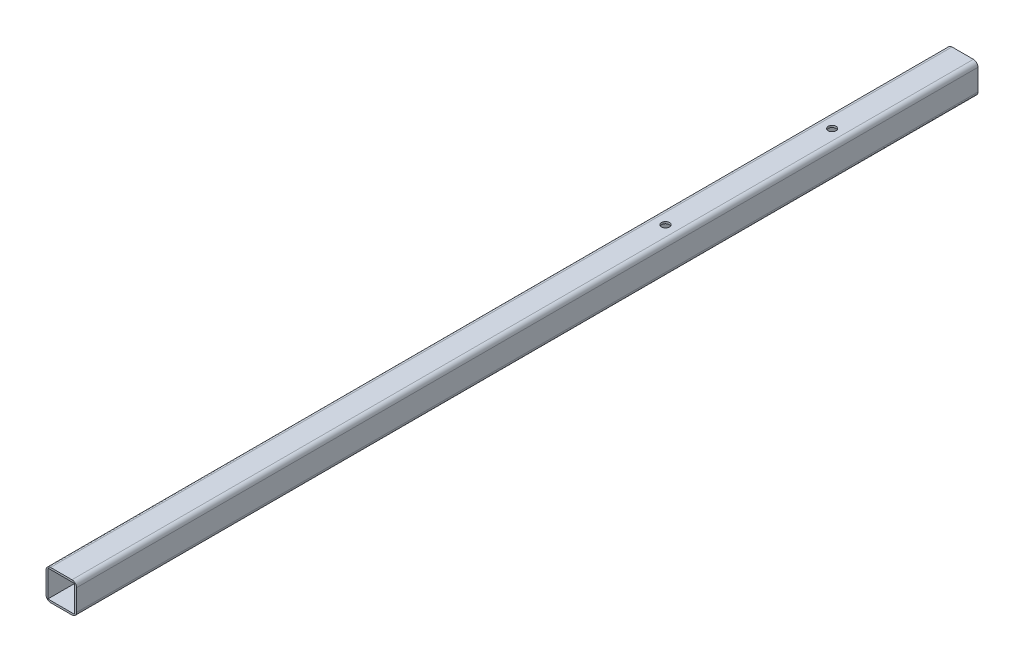
ISO-10303-21;
HEADER;
FILE_DESCRIPTION(('STEP AP214'),'2;1');
FILE_NAME('part.step','',(''),(''),'','','');
FILE_SCHEMA(('AUTOMOTIVE_DESIGN { 1 0 10303 214 1 1 1 1 }'));
ENDSEC;
DATA;
#1=APPLICATION_CONTEXT('core data for automotive mechanical design processes');
#2=APPLICATION_PROTOCOL_DEFINITION('international standard','automotive_design',2000,#1);
#3=PRODUCT_CONTEXT('',#1,'mechanical');
#4=PRODUCT('Part','Part','',(#3));
#5=PRODUCT_RELATED_PRODUCT_CATEGORY('part','',(#4));
#6=PRODUCT_DEFINITION_FORMATION('','',#4);
#7=PRODUCT_DEFINITION_CONTEXT('part definition',#1,'design');
#8=PRODUCT_DEFINITION('design','',#6,#7);
#9=PRODUCT_DEFINITION_SHAPE('','',#8);
#10=(LENGTH_UNIT() NAMED_UNIT(*) SI_UNIT(.MILLI.,.METRE.));
#11=(NAMED_UNIT(*) PLANE_ANGLE_UNIT() SI_UNIT($,.RADIAN.));
#12=(NAMED_UNIT(*) SI_UNIT($,.STERADIAN.) SOLID_ANGLE_UNIT());
#13=UNCERTAINTY_MEASURE_WITH_UNIT(LENGTH_MEASURE(1.E-05),#10,'distance_accuracy_value','');
#14=(GEOMETRIC_REPRESENTATION_CONTEXT(3) GLOBAL_UNCERTAINTY_ASSIGNED_CONTEXT((#13)) GLOBAL_UNIT_ASSIGNED_CONTEXT((#10,
#11,#12)) REPRESENTATION_CONTEXT('',''));
#15=CARTESIAN_POINT('',(0.,0.,0.));
#16=DIRECTION('',(0.,0.,1.));
#17=DIRECTION('',(1.,0.,0.));
#18=AXIS2_PLACEMENT_3D('',#15,#16,#17);
#19=CARTESIAN_POINT('',(0.,0.,374.65));
#20=DIRECTION('',(0.,0.,-1.));
#21=DIRECTION('',(-1.,0.,0.));
#22=AXIS2_PLACEMENT_3D('',#19,#20,#21);
#23=PLANE('',#22);
#24=DIRECTION('',(0.,-1.,0.));
#25=VECTOR('',#24,1.);
#26=CARTESIAN_POINT('',(-12.7,-12.7,374.65));
#27=LINE('',#26,#25);
#28=CARTESIAN_POINT('',(-12.7,8.89,374.65));
#29=VERTEX_POINT('',#28);
#30=CARTESIAN_POINT('',(-12.7,-8.89,374.65));
#31=VERTEX_POINT('',#30);
#32=EDGE_CURVE('E184',#29,#31,#27,.T.);
#33=ORIENTED_EDGE('',*,*,#32,.T.);
#34=CARTESIAN_POINT('',(-8.89,-8.89,374.65));
#35=DIRECTION('',(0.,0.,-1.));
#36=DIRECTION('',(-1.,0.,0.));
#37=AXIS2_PLACEMENT_3D('',#34,#35,#36);
#38=CIRCLE('',#37,3.81);
#39=CARTESIAN_POINT('',(-8.89,-12.7,374.65));
#40=VERTEX_POINT('',#39);
#41=EDGE_CURVE('E222',#31,#40,#38,.F.);
#42=ORIENTED_EDGE('',*,*,#41,.T.);
#43=DIRECTION('',(1.,0.,0.));
#44=VECTOR('',#43,1.);
#45=CARTESIAN_POINT('',(-12.7,-12.7,374.65));
#46=LINE('',#45,#44);
#47=CARTESIAN_POINT('',(8.89,-12.7,374.65));
#48=VERTEX_POINT('',#47);
#49=EDGE_CURVE('E187',#40,#48,#46,.T.);
#50=ORIENTED_EDGE('',*,*,#49,.T.);
#51=CARTESIAN_POINT('',(8.89,-8.89,374.65));
#52=DIRECTION('',(0.,0.,-1.));
#53=DIRECTION('',(-1.,0.,0.));
#54=AXIS2_PLACEMENT_3D('',#51,#52,#53);
#55=CIRCLE('',#54,3.81);
#56=CARTESIAN_POINT('',(12.7,-8.89,374.65));
#57=VERTEX_POINT('',#56);
#58=EDGE_CURVE('E220',#48,#57,#55,.F.);
#59=ORIENTED_EDGE('',*,*,#58,.T.);
#60=DIRECTION('',(0.,1.,0.));
#61=VECTOR('',#60,1.);
#62=CARTESIAN_POINT('',(12.7,-12.7,374.65));
#63=LINE('',#62,#61);
#64=CARTESIAN_POINT('',(12.7,8.89,374.65));
#65=VERTEX_POINT('',#64);
#66=EDGE_CURVE('E179',#57,#65,#63,.T.);
#67=ORIENTED_EDGE('',*,*,#66,.T.);
#68=CARTESIAN_POINT('',(8.89,8.89,374.65));
#69=DIRECTION('',(0.,0.,-1.));
#70=DIRECTION('',(-1.,0.,0.));
#71=AXIS2_PLACEMENT_3D('',#68,#69,#70);
#72=CIRCLE('',#71,3.81);
#73=CARTESIAN_POINT('',(8.89,12.7,374.65));
#74=VERTEX_POINT('',#73);
#75=EDGE_CURVE('E66',#65,#74,#72,.F.);
#76=ORIENTED_EDGE('',*,*,#75,.T.);
#77=DIRECTION('',(-1.,0.,0.));
#78=VECTOR('',#77,1.);
#79=CARTESIAN_POINT('',(-12.7,12.7,374.65));
#80=LINE('',#79,#78);
#81=CARTESIAN_POINT('',(-8.89,12.7,374.65));
#82=VERTEX_POINT('',#81);
#83=EDGE_CURVE('E181',#74,#82,#80,.T.);
#84=ORIENTED_EDGE('',*,*,#83,.T.);
#85=CARTESIAN_POINT('',(-8.89,8.89,374.65));
#86=DIRECTION('',(0.,0.,-1.));
#87=DIRECTION('',(-1.,0.,0.));
#88=AXIS2_PLACEMENT_3D('',#85,#86,#87);
#89=CIRCLE('',#88,3.81);
#90=EDGE_CURVE('E218',#82,#29,#89,.F.);
#91=ORIENTED_EDGE('',*,*,#90,.T.);
#92=EDGE_LOOP('',(#33,#42,#50,#59,#67,#76,#84,#91));
#93=FACE_BOUND('',#92,.T.);
#94=DIRECTION('',(0.,-1.,0.));
#95=VECTOR('',#94,1.);
#96=CARTESIAN_POINT('',(-11.1125,-11.1125,374.65));
#97=LINE('',#96,#95);
#98=CARTESIAN_POINT('',(-11.1125,11.1125,374.65));
#99=VERTEX_POINT('',#98);
#100=CARTESIAN_POINT('',(-11.1125,-11.1125,374.65));
#101=VERTEX_POINT('',#100);
#102=EDGE_CURVE('E136',#99,#101,#97,.T.);
#103=ORIENTED_EDGE('',*,*,#102,.F.);
#104=DIRECTION('',(-1.,0.,0.));
#105=VECTOR('',#104,1.);
#106=CARTESIAN_POINT('',(-11.1125,11.1125,374.65));
#107=LINE('',#106,#105);
#108=CARTESIAN_POINT('',(11.1125,11.1125,374.65));
#109=VERTEX_POINT('',#108);
#110=EDGE_CURVE('E161',#109,#99,#107,.T.);
#111=ORIENTED_EDGE('',*,*,#110,.F.);
#112=DIRECTION('',(0.,1.,0.));
#113=VECTOR('',#112,1.);
#114=CARTESIAN_POINT('',(11.1125,-11.1125,374.65));
#115=LINE('',#114,#113);
#116=CARTESIAN_POINT('',(11.1125,-11.1125,374.65));
#117=VERTEX_POINT('',#116);
#118=EDGE_CURVE('E159',#117,#109,#115,.T.);
#119=ORIENTED_EDGE('',*,*,#118,.F.);
#120=DIRECTION('',(1.,0.,0.));
#121=VECTOR('',#120,1.);
#122=CARTESIAN_POINT('',(-11.1125,-11.1125,374.65));
#123=LINE('',#122,#121);
#124=EDGE_CURVE('E146',#101,#117,#123,.T.);
#125=ORIENTED_EDGE('',*,*,#124,.F.);
#126=EDGE_LOOP('',(#103,#111,#119,#125));
#127=FACE_BOUND('',#126,.T.);
#128=ADVANCED_FACE('F44',(#93,#127),#23,.F.);
#129=CARTESIAN_POINT('',(0.,0.,-374.65));
#130=DIRECTION('',(0.,0.,-1.));
#131=DIRECTION('',(-1.,0.,0.));
#132=AXIS2_PLACEMENT_3D('',#129,#130,#131);
#133=PLANE('',#132);
#134=DIRECTION('',(1.,0.,0.));
#135=VECTOR('',#134,1.);
#136=CARTESIAN_POINT('',(-12.7,-12.7,-374.65));
#137=LINE('',#136,#135);
#138=CARTESIAN_POINT('',(-8.89,-12.7,-374.65));
#139=VERTEX_POINT('',#138);
#140=CARTESIAN_POINT('',(8.89,-12.7,-374.65));
#141=VERTEX_POINT('',#140);
#142=EDGE_CURVE('E182',#139,#141,#137,.T.);
#143=ORIENTED_EDGE('',*,*,#142,.F.);
#144=CARTESIAN_POINT('',(-8.89,-8.89,-374.65));
#145=DIRECTION('',(0.,0.,-1.));
#146=DIRECTION('',(-1.,0.,0.));
#147=AXIS2_PLACEMENT_3D('',#144,#145,#146);
#148=CIRCLE('',#147,3.81);
#149=CARTESIAN_POINT('',(-12.7,-8.89,-374.65));
#150=VERTEX_POINT('',#149);
#151=EDGE_CURVE('E210',#139,#150,#148,.T.);
#152=ORIENTED_EDGE('',*,*,#151,.T.);
#153=DIRECTION('',(0.,-1.,0.));
#154=VECTOR('',#153,1.);
#155=CARTESIAN_POINT('',(-12.7,-12.7,-374.65));
#156=LINE('',#155,#154);
#157=CARTESIAN_POINT('',(-12.7,8.89,-374.65));
#158=VERTEX_POINT('',#157);
#159=EDGE_CURVE('E195',#158,#150,#156,.T.);
#160=ORIENTED_EDGE('',*,*,#159,.F.);
#161=CARTESIAN_POINT('',(-8.89,8.89,-374.65));
#162=DIRECTION('',(0.,0.,-1.));
#163=DIRECTION('',(-1.,0.,0.));
#164=AXIS2_PLACEMENT_3D('',#161,#162,#163);
#165=CIRCLE('',#164,3.81);
#166=CARTESIAN_POINT('',(-8.89,12.7,-374.65));
#167=VERTEX_POINT('',#166);
#168=EDGE_CURVE('E206',#158,#167,#165,.T.);
#169=ORIENTED_EDGE('',*,*,#168,.T.);
#170=DIRECTION('',(-1.,0.,0.));
#171=VECTOR('',#170,1.);
#172=CARTESIAN_POINT('',(-12.7,12.7,-374.65));
#173=LINE('',#172,#171);
#174=CARTESIAN_POINT('',(8.89,12.7,-374.65));
#175=VERTEX_POINT('',#174);
#176=EDGE_CURVE('E193',#175,#167,#173,.T.);
#177=ORIENTED_EDGE('',*,*,#176,.F.);
#178=CARTESIAN_POINT('',(8.89,8.89,-374.65));
#179=DIRECTION('',(0.,0.,-1.));
#180=DIRECTION('',(-1.,0.,0.));
#181=AXIS2_PLACEMENT_3D('',#178,#179,#180);
#182=CIRCLE('',#181,3.81);
#183=CARTESIAN_POINT('',(12.7,8.89,-374.65));
#184=VERTEX_POINT('',#183);
#185=EDGE_CURVE('E204',#175,#184,#182,.T.);
#186=ORIENTED_EDGE('',*,*,#185,.T.);
#187=DIRECTION('',(0.,1.,0.));
#188=VECTOR('',#187,1.);
#189=CARTESIAN_POINT('',(12.7,-12.7,-374.65));
#190=LINE('',#189,#188);
#191=CARTESIAN_POINT('',(12.7,-8.89,-374.65));
#192=VERTEX_POINT('',#191);
#193=EDGE_CURVE('E154',#192,#184,#190,.T.);
#194=ORIENTED_EDGE('',*,*,#193,.F.);
#195=CARTESIAN_POINT('',(8.89,-8.89,-374.65));
#196=DIRECTION('',(0.,0.,-1.));
#197=DIRECTION('',(-1.,0.,0.));
#198=AXIS2_PLACEMENT_3D('',#195,#196,#197);
#199=CIRCLE('',#198,3.81);
#200=EDGE_CURVE('E208',#192,#141,#199,.T.);
#201=ORIENTED_EDGE('',*,*,#200,.T.);
#202=EDGE_LOOP('',(#143,#152,#160,#169,#177,#186,#194,#201));
#203=FACE_BOUND('',#202,.T.);
#204=DIRECTION('',(-1.,0.,0.));
#205=VECTOR('',#204,1.);
#206=CARTESIAN_POINT('',(-11.1125,11.1125,-374.65));
#207=LINE('',#206,#205);
#208=CARTESIAN_POINT('',(11.1125,11.1125,-374.65));
#209=VERTEX_POINT('',#208);
#210=CARTESIAN_POINT('',(-11.1125,11.1125,-374.65));
#211=VERTEX_POINT('',#210);
#212=EDGE_CURVE('E147',#209,#211,#207,.T.);
#213=ORIENTED_EDGE('',*,*,#212,.T.);
#214=DIRECTION('',(0.,-1.,0.));
#215=VECTOR('',#214,1.);
#216=CARTESIAN_POINT('',(-11.1125,-11.1125,-374.65));
#217=LINE('',#216,#215);
#218=CARTESIAN_POINT('',(-11.1125,-11.1125,-374.65));
#219=VERTEX_POINT('',#218);
#220=EDGE_CURVE('E166',#211,#219,#217,.T.);
#221=ORIENTED_EDGE('',*,*,#220,.T.);
#222=DIRECTION('',(1.,0.,0.));
#223=VECTOR('',#222,1.);
#224=CARTESIAN_POINT('',(-11.1125,-11.1125,-374.65));
#225=LINE('',#224,#223);
#226=CARTESIAN_POINT('',(11.1125,-11.1125,-374.65));
#227=VERTEX_POINT('',#226);
#228=EDGE_CURVE('E153',#219,#227,#225,.T.);
#229=ORIENTED_EDGE('',*,*,#228,.T.);
#230=DIRECTION('',(0.,1.,0.));
#231=VECTOR('',#230,1.);
#232=CARTESIAN_POINT('',(11.1125,-11.1125,-374.65));
#233=LINE('',#232,#231);
#234=EDGE_CURVE('E170',#227,#209,#233,.T.);
#235=ORIENTED_EDGE('',*,*,#234,.T.);
#236=EDGE_LOOP('',(#213,#221,#229,#235));
#237=FACE_BOUND('',#236,.T.);
#238=ADVANCED_FACE('F270',(#203,#237),#133,.T.);
#239=CARTESIAN_POINT('',(12.7,-12.7,374.65));
#240=DIRECTION('',(-1.,0.,0.));
#241=DIRECTION('',(0.,0.,1.));
#242=AXIS2_PLACEMENT_3D('',#239,#240,#241);
#243=PLANE('',#242);
#244=ORIENTED_EDGE('',*,*,#66,.F.);
#245=DIRECTION('',(0.,0.,-1.));
#246=VECTOR('',#245,1.);
#247=CARTESIAN_POINT('',(12.7,-8.89,374.65));
#248=LINE('',#247,#246);
#249=EDGE_CURVE('E226',#57,#192,#248,.T.);
#250=ORIENTED_EDGE('',*,*,#249,.T.);
#251=ORIENTED_EDGE('',*,*,#193,.T.);
#252=DIRECTION('',(0.,0.,-1.));
#253=VECTOR('',#252,1.);
#254=CARTESIAN_POINT('',(12.7,8.89,374.65));
#255=LINE('',#254,#253);
#256=EDGE_CURVE('E224',#184,#65,#255,.F.);
#257=ORIENTED_EDGE('',*,*,#256,.T.);
#258=EDGE_LOOP('',(#244,#250,#251,#257));
#259=FACE_BOUND('',#258,.T.);
#260=ADVANCED_FACE('F284',(#259),#243,.F.);
#261=CARTESIAN_POINT('',(-12.7,12.7,374.65));
#262=DIRECTION('',(0.,-1.,0.));
#263=DIRECTION('',(0.,0.,-1.));
#264=AXIS2_PLACEMENT_3D('',#261,#262,#263);
#265=PLANE('',#264);
#266=CARTESIAN_POINT('',(1.30451205393456E-12,12.7,-127.595452029903));
#267=DIRECTION('',(0.,1.,0.));
#268=DIRECTION('',(0.,0.,1.));
#269=AXIS2_PLACEMENT_3D('',#266,#267,#268);
#270=CIRCLE('',#269,3.26389999999999);
#271=CARTESIAN_POINT('',(1.30451205393456E-12,12.7,-124.331552029903));
#272=VERTEX_POINT('',#271);
#273=EDGE_CURVE('E239',#272,#272,#270,.T.);
#274=ORIENTED_EDGE('',*,*,#273,.F.);
#275=EDGE_LOOP('',(#274));
#276=FACE_BOUND('',#275,.T.);
#277=CARTESIAN_POINT('',(-1.81441472339482E-11,12.7,-266.10454797007));
#278=DIRECTION('',(0.,1.,0.));
#279=DIRECTION('',(0.,0.,1.));
#280=AXIS2_PLACEMENT_3D('',#277,#278,#279);
#281=CIRCLE('',#280,3.2639);
#282=CARTESIAN_POINT('',(-1.81441472339482E-11,12.7,-262.84064797007));
#283=VERTEX_POINT('',#282);
#284=EDGE_CURVE('E244',#283,#283,#281,.T.);
#285=ORIENTED_EDGE('',*,*,#284,.F.);
#286=EDGE_LOOP('',(#285));
#287=FACE_BOUND('',#286,.T.);
#288=ORIENTED_EDGE('',*,*,#176,.T.);
#289=DIRECTION('',(0.,0.,-1.));
#290=VECTOR('',#289,1.);
#291=CARTESIAN_POINT('',(-8.89,12.7,374.65));
#292=LINE('',#291,#290);
#293=EDGE_CURVE('E11',#167,#82,#292,.F.);
#294=ORIENTED_EDGE('',*,*,#293,.T.);
#295=ORIENTED_EDGE('',*,*,#83,.F.);
#296=DIRECTION('',(0.,0.,-1.));
#297=VECTOR('',#296,1.);
#298=CARTESIAN_POINT('',(8.89,12.7,374.65));
#299=LINE('',#298,#297);
#300=EDGE_CURVE('E53',#74,#175,#299,.T.);
#301=ORIENTED_EDGE('',*,*,#300,.T.);
#302=EDGE_LOOP('',(#288,#294,#295,#301));
#303=FACE_BOUND('',#302,.T.);
#304=ADVANCED_FACE('F295',(#276,#287,#303),#265,.F.);
#305=CARTESIAN_POINT('',(-12.7,-12.7,374.65));
#306=DIRECTION('',(1.,0.,0.));
#307=DIRECTION('',(0.,0.,-1.));
#308=AXIS2_PLACEMENT_3D('',#305,#306,#307);
#309=PLANE('',#308);
#310=ORIENTED_EDGE('',*,*,#159,.T.);
#311=DIRECTION('',(0.,0.,-1.));
#312=VECTOR('',#311,1.);
#313=CARTESIAN_POINT('',(-12.7,-8.89,374.65));
#314=LINE('',#313,#312);
#315=EDGE_CURVE('E215',#150,#31,#314,.F.);
#316=ORIENTED_EDGE('',*,*,#315,.T.);
#317=ORIENTED_EDGE('',*,*,#32,.F.);
#318=DIRECTION('',(0.,0.,-1.));
#319=VECTOR('',#318,1.);
#320=CARTESIAN_POINT('',(-12.7,8.89,374.65));
#321=LINE('',#320,#319);
#322=EDGE_CURVE('E212',#29,#158,#321,.T.);
#323=ORIENTED_EDGE('',*,*,#322,.T.);
#324=EDGE_LOOP('',(#310,#316,#317,#323));
#325=FACE_BOUND('',#324,.T.);
#326=ADVANCED_FACE('F292',(#325),#309,.F.);
#327=CARTESIAN_POINT('',(-12.7,-12.7,374.65));
#328=DIRECTION('',(0.,1.,0.));
#329=DIRECTION('',(0.,0.,1.));
#330=AXIS2_PLACEMENT_3D('',#327,#328,#329);
#331=PLANE('',#330);
#332=CARTESIAN_POINT('',(1.30451205393456E-12,-12.7,-127.595452029903));
#333=DIRECTION('',(0.,1.,0.));
#334=DIRECTION('',(0.,0.,1.));
#335=AXIS2_PLACEMENT_3D('',#332,#333,#334);
#336=CIRCLE('',#335,3.26389999999999);
#337=CARTESIAN_POINT('',(1.30451205393456E-12,-12.7,-124.331552029903));
#338=VERTEX_POINT('',#337);
#339=EDGE_CURVE('E233',#338,#338,#336,.T.);
#340=ORIENTED_EDGE('',*,*,#339,.T.);
#341=EDGE_LOOP('',(#340));
#342=FACE_BOUND('',#341,.T.);
#343=CARTESIAN_POINT('',(-1.81441472339482E-11,-12.7,-266.10454797007));
#344=DIRECTION('',(0.,1.,0.));
#345=DIRECTION('',(0.,0.,1.));
#346=AXIS2_PLACEMENT_3D('',#343,#344,#345);
#347=CIRCLE('',#346,3.2639);
#348=CARTESIAN_POINT('',(-1.81441472339482E-11,-12.7,-262.84064797007));
#349=VERTEX_POINT('',#348);
#350=EDGE_CURVE('E249',#349,#349,#347,.T.);
#351=ORIENTED_EDGE('',*,*,#350,.T.);
#352=EDGE_LOOP('',(#351));
#353=FACE_BOUND('',#352,.T.);
#354=ORIENTED_EDGE('',*,*,#49,.F.);
#355=DIRECTION('',(0.,0.,-1.));
#356=VECTOR('',#355,1.);
#357=CARTESIAN_POINT('',(-8.89,-12.7,374.65));
#358=LINE('',#357,#356);
#359=EDGE_CURVE('E201',#40,#139,#358,.T.);
#360=ORIENTED_EDGE('',*,*,#359,.T.);
#361=ORIENTED_EDGE('',*,*,#142,.T.);
#362=DIRECTION('',(0.,0.,-1.));
#363=VECTOR('',#362,1.);
#364=CARTESIAN_POINT('',(8.89,-12.7,374.65));
#365=LINE('',#364,#363);
#366=EDGE_CURVE('E190',#141,#48,#365,.F.);
#367=ORIENTED_EDGE('',*,*,#366,.T.);
#368=EDGE_LOOP('',(#354,#360,#361,#367));
#369=FACE_BOUND('',#368,.T.);
#370=ADVANCED_FACE('F289',(#342,#353,#369),#331,.F.);
#371=CARTESIAN_POINT('',(-11.1125,-11.1125,374.65));
#372=DIRECTION('',(1.,0.,0.));
#373=DIRECTION('',(0.,0.,-1.));
#374=AXIS2_PLACEMENT_3D('',#371,#372,#373);
#375=PLANE('',#374);
#376=ORIENTED_EDGE('',*,*,#220,.F.);
#377=DIRECTION('',(0.,0.,-1.));
#378=VECTOR('',#377,1.);
#379=CARTESIAN_POINT('',(-11.1125,11.1125,374.65));
#380=LINE('',#379,#378);
#381=EDGE_CURVE('E142',#99,#211,#380,.T.);
#382=ORIENTED_EDGE('',*,*,#381,.F.);
#383=ORIENTED_EDGE('',*,*,#102,.T.);
#384=DIRECTION('',(0.,0.,-1.));
#385=VECTOR('',#384,1.);
#386=CARTESIAN_POINT('',(-11.1125,-11.1125,374.65));
#387=LINE('',#386,#385);
#388=EDGE_CURVE('E139',#101,#219,#387,.T.);
#389=ORIENTED_EDGE('',*,*,#388,.T.);
#390=EDGE_LOOP('',(#376,#382,#383,#389));
#391=FACE_BOUND('',#390,.T.);
#392=ADVANCED_FACE('F138',(#391),#375,.T.);
#393=CARTESIAN_POINT('',(-11.1125,-11.1125,374.65));
#394=DIRECTION('',(0.,1.,0.));
#395=DIRECTION('',(0.,0.,1.));
#396=AXIS2_PLACEMENT_3D('',#393,#394,#395);
#397=PLANE('',#396);
#398=CARTESIAN_POINT('',(1.30451205393456E-12,-11.1125,-127.595452029903));
#399=DIRECTION('',(0.,1.,0.));
#400=DIRECTION('',(0.,0.,1.));
#401=AXIS2_PLACEMENT_3D('',#398,#399,#400);
#402=CIRCLE('',#401,3.26389999999999);
#403=CARTESIAN_POINT('',(1.30451205393456E-12,-11.1125,-124.331552029903));
#404=VERTEX_POINT('',#403);
#405=EDGE_CURVE('E168',#404,#404,#402,.T.);
#406=ORIENTED_EDGE('',*,*,#405,.F.);
#407=EDGE_LOOP('',(#406));
#408=FACE_BOUND('',#407,.T.);
#409=CARTESIAN_POINT('',(-1.81441472339482E-11,-11.1125,-266.10454797007));
#410=DIRECTION('',(0.,1.,0.));
#411=DIRECTION('',(0.,0.,1.));
#412=AXIS2_PLACEMENT_3D('',#409,#410,#411);
#413=CIRCLE('',#412,3.2639);
#414=CARTESIAN_POINT('',(-1.81441472339482E-11,-11.1125,-262.84064797007));
#415=VERTEX_POINT('',#414);
#416=EDGE_CURVE('E232',#415,#415,#413,.T.);
#417=ORIENTED_EDGE('',*,*,#416,.F.);
#418=EDGE_LOOP('',(#417));
#419=FACE_BOUND('',#418,.T.);
#420=ORIENTED_EDGE('',*,*,#228,.F.);
#421=ORIENTED_EDGE('',*,*,#388,.F.);
#422=ORIENTED_EDGE('',*,*,#124,.T.);
#423=DIRECTION('',(0.,0.,-1.));
#424=VECTOR('',#423,1.);
#425=CARTESIAN_POINT('',(11.1125,-11.1125,374.65));
#426=LINE('',#425,#424);
#427=EDGE_CURVE('E155',#117,#227,#426,.T.);
#428=ORIENTED_EDGE('',*,*,#427,.T.);
#429=EDGE_LOOP('',(#420,#421,#422,#428));
#430=FACE_BOUND('',#429,.T.);
#431=ADVANCED_FACE('F150',(#408,#419,#430),#397,.T.);
#432=CARTESIAN_POINT('',(11.1125,-11.1125,374.65));
#433=DIRECTION('',(-1.,0.,0.));
#434=DIRECTION('',(0.,0.,1.));
#435=AXIS2_PLACEMENT_3D('',#432,#433,#434);
#436=PLANE('',#435);
#437=ORIENTED_EDGE('',*,*,#234,.F.);
#438=ORIENTED_EDGE('',*,*,#427,.F.);
#439=ORIENTED_EDGE('',*,*,#118,.T.);
#440=DIRECTION('',(0.,0.,-1.));
#441=VECTOR('',#440,1.);
#442=CARTESIAN_POINT('',(11.1125,11.1125,374.65));
#443=LINE('',#442,#441);
#444=EDGE_CURVE('E176',#109,#209,#443,.T.);
#445=ORIENTED_EDGE('',*,*,#444,.T.);
#446=EDGE_LOOP('',(#437,#438,#439,#445));
#447=FACE_BOUND('',#446,.T.);
#448=ADVANCED_FACE('F264',(#447),#436,.T.);
#449=CARTESIAN_POINT('',(-11.1125,11.1125,374.65));
#450=DIRECTION('',(0.,-1.,0.));
#451=DIRECTION('',(1.,0.,0.));
#452=AXIS2_PLACEMENT_3D('',#449,#450,#451);
#453=PLANE('',#452);
#454=CARTESIAN_POINT('',(1.30451205393456E-12,11.1125,-127.595452029903));
#455=DIRECTION('',(0.,-1.,0.));
#456=DIRECTION('',(1.,0.,0.));
#457=AXIS2_PLACEMENT_3D('',#454,#455,#456);
#458=CIRCLE('',#457,3.26389999999999);
#459=CARTESIAN_POINT('',(3.2639000000013,11.1125,-127.595452029903));
#460=VERTEX_POINT('',#459);
#461=EDGE_CURVE('E48',#460,#460,#458,.T.);
#462=ORIENTED_EDGE('',*,*,#461,.F.);
#463=EDGE_LOOP('',(#462));
#464=FACE_BOUND('',#463,.T.);
#465=CARTESIAN_POINT('',(-1.81441472339482E-11,11.1125,-266.10454797007));
#466=DIRECTION('',(0.,-1.,0.));
#467=DIRECTION('',(1.,0.,0.));
#468=AXIS2_PLACEMENT_3D('',#465,#466,#467);
#469=CIRCLE('',#468,3.2639);
#470=CARTESIAN_POINT('',(3.26389999998186,11.1125,-266.10454797007));
#471=VERTEX_POINT('',#470);
#472=EDGE_CURVE('E230',#471,#471,#469,.T.);
#473=ORIENTED_EDGE('',*,*,#472,.F.);
#474=EDGE_LOOP('',(#473));
#475=FACE_BOUND('',#474,.T.);
#476=ORIENTED_EDGE('',*,*,#212,.F.);
#477=ORIENTED_EDGE('',*,*,#444,.F.);
#478=ORIENTED_EDGE('',*,*,#110,.T.);
#479=ORIENTED_EDGE('',*,*,#381,.T.);
#480=EDGE_LOOP('',(#476,#477,#478,#479));
#481=FACE_BOUND('',#480,.T.);
#482=ADVANCED_FACE('F260',(#464,#475,#481),#453,.T.);
#483=CARTESIAN_POINT('',(-8.89,-8.89,374.65));
#484=DIRECTION('',(0.,0.,-1.));
#485=DIRECTION('',(-1.,0.,0.));
#486=AXIS2_PLACEMENT_3D('',#483,#484,#485);
#487=CYLINDRICAL_SURFACE('',#486,3.81);
#488=ORIENTED_EDGE('',*,*,#41,.F.);
#489=ORIENTED_EDGE('',*,*,#315,.F.);
#490=ORIENTED_EDGE('',*,*,#151,.F.);
#491=ORIENTED_EDGE('',*,*,#359,.F.);
#492=EDGE_LOOP('',(#488,#489,#490,#491));
#493=FACE_BOUND('',#492,.T.);
#494=ADVANCED_FACE('F263',(#493),#487,.T.);
#495=CARTESIAN_POINT('',(8.89,-8.89,374.65));
#496=DIRECTION('',(0.,0.,-1.));
#497=DIRECTION('',(-1.,0.,0.));
#498=AXIS2_PLACEMENT_3D('',#495,#496,#497);
#499=CYLINDRICAL_SURFACE('',#498,3.81);
#500=ORIENTED_EDGE('',*,*,#58,.F.);
#501=ORIENTED_EDGE('',*,*,#366,.F.);
#502=ORIENTED_EDGE('',*,*,#200,.F.);
#503=ORIENTED_EDGE('',*,*,#249,.F.);
#504=EDGE_LOOP('',(#500,#501,#502,#503));
#505=FACE_BOUND('',#504,.T.);
#506=ADVANCED_FACE('F305',(#505),#499,.T.);
#507=CARTESIAN_POINT('',(-8.89,8.89,374.65));
#508=DIRECTION('',(0.,0.,-1.));
#509=DIRECTION('',(-1.,0.,0.));
#510=AXIS2_PLACEMENT_3D('',#507,#508,#509);
#511=CYLINDRICAL_SURFACE('',#510,3.81);
#512=ORIENTED_EDGE('',*,*,#90,.F.);
#513=ORIENTED_EDGE('',*,*,#293,.F.);
#514=ORIENTED_EDGE('',*,*,#168,.F.);
#515=ORIENTED_EDGE('',*,*,#322,.F.);
#516=EDGE_LOOP('',(#512,#513,#514,#515));
#517=FACE_BOUND('',#516,.T.);
#518=ADVANCED_FACE('F308',(#517),#511,.T.);
#519=CARTESIAN_POINT('',(8.89,8.89,374.65));
#520=DIRECTION('',(0.,0.,-1.));
#521=DIRECTION('',(-1.,0.,0.));
#522=AXIS2_PLACEMENT_3D('',#519,#520,#521);
#523=CYLINDRICAL_SURFACE('',#522,3.81);
#524=ORIENTED_EDGE('',*,*,#75,.F.);
#525=ORIENTED_EDGE('',*,*,#256,.F.);
#526=ORIENTED_EDGE('',*,*,#185,.F.);
#527=ORIENTED_EDGE('',*,*,#300,.F.);
#528=EDGE_LOOP('',(#524,#525,#526,#527));
#529=FACE_BOUND('',#528,.T.);
#530=ADVANCED_FACE('F46',(#529),#523,.T.);
#531=CARTESIAN_POINT('',(-1.81441472339482E-11,-12.7,-266.10454797007));
#532=DIRECTION('',(0.,1.,0.));
#533=DIRECTION('',(0.,0.,1.));
#534=AXIS2_PLACEMENT_3D('',#531,#532,#533);
#535=CYLINDRICAL_SURFACE('',#534,3.2639);
#536=ORIENTED_EDGE('',*,*,#472,.T.);
#537=EDGE_LOOP('',(#536));
#538=FACE_BOUND('',#537,.T.);
#539=ORIENTED_EDGE('',*,*,#284,.T.);
#540=EDGE_LOOP('',(#539));
#541=FACE_BOUND('',#540,.T.);
#542=ADVANCED_FACE('F315',(#538,#541),#535,.F.);
#543=CARTESIAN_POINT('',(1.30451205393456E-12,-12.7,-127.595452029903));
#544=DIRECTION('',(0.,1.,0.));
#545=DIRECTION('',(0.,0.,1.));
#546=AXIS2_PLACEMENT_3D('',#543,#544,#545);
#547=CYLINDRICAL_SURFACE('',#546,3.26389999999999);
#548=ORIENTED_EDGE('',*,*,#461,.T.);
#549=EDGE_LOOP('',(#548));
#550=FACE_BOUND('',#549,.T.);
#551=ORIENTED_EDGE('',*,*,#273,.T.);
#552=EDGE_LOOP('',(#551));
#553=FACE_BOUND('',#552,.T.);
#554=ADVANCED_FACE('F257',(#550,#553),#547,.F.);
#555=ORIENTED_EDGE('',*,*,#416,.T.);
#556=EDGE_LOOP('',(#555));
#557=FACE_BOUND('',#556,.T.);
#558=ORIENTED_EDGE('',*,*,#350,.F.);
#559=EDGE_LOOP('',(#558));
#560=FACE_BOUND('',#559,.T.);
#561=ADVANCED_FACE('F339',(#557,#560),#535,.F.);
#562=ORIENTED_EDGE('',*,*,#405,.T.);
#563=EDGE_LOOP('',(#562));
#564=FACE_BOUND('',#563,.T.);
#565=ORIENTED_EDGE('',*,*,#339,.F.);
#566=EDGE_LOOP('',(#565));
#567=FACE_BOUND('',#566,.T.);
#568=ADVANCED_FACE('F344',(#564,#567),#547,.F.);
#569=CLOSED_SHELL('',(#128,#238,#260,#304,#326,#370,#392,#431,#448,#482,#494,#506,#518,#530,
#542,#554,#561,#568));
#570=MANIFOLD_SOLID_BREP('B2',#569);
#571=ADVANCED_BREP_SHAPE_REPRESENTATION('',(#18,#570),#14);
#572=SHAPE_DEFINITION_REPRESENTATION(#9,#571);
ENDSEC;
END-ISO-10303-21;
